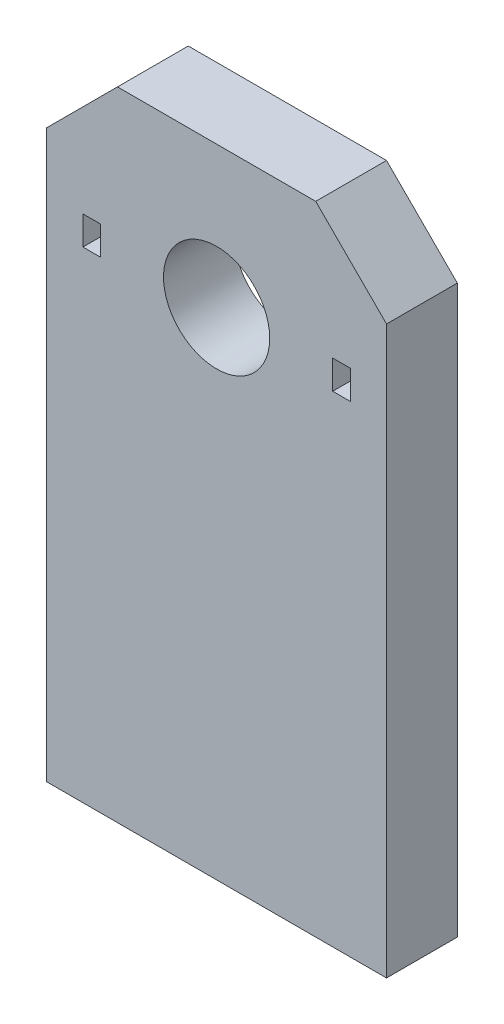
ISO-10303-21;
HEADER;
FILE_DESCRIPTION(('STEP AP214'),'2;1');
FILE_NAME('part.step','',(''),(''),'','','');
FILE_SCHEMA(('AUTOMOTIVE_DESIGN { 1 0 10303 214 1 1 1 1 }'));
ENDSEC;
DATA;
#1=APPLICATION_CONTEXT('core data for automotive mechanical design processes');
#2=APPLICATION_PROTOCOL_DEFINITION('international standard','automotive_design',2000,#1);
#3=PRODUCT_CONTEXT('',#1,'mechanical');
#4=PRODUCT('Part','Part','',(#3));
#5=PRODUCT_RELATED_PRODUCT_CATEGORY('part','',(#4));
#6=PRODUCT_DEFINITION_FORMATION('','',#4);
#7=PRODUCT_DEFINITION_CONTEXT('part definition',#1,'design');
#8=PRODUCT_DEFINITION('design','',#6,#7);
#9=PRODUCT_DEFINITION_SHAPE('','',#8);
#10=(LENGTH_UNIT() NAMED_UNIT(*) SI_UNIT(.MILLI.,.METRE.));
#11=(NAMED_UNIT(*) PLANE_ANGLE_UNIT() SI_UNIT($,.RADIAN.));
#12=(NAMED_UNIT(*) SI_UNIT($,.STERADIAN.) SOLID_ANGLE_UNIT());
#13=UNCERTAINTY_MEASURE_WITH_UNIT(LENGTH_MEASURE(1.E-05),#10,'distance_accuracy_value','');
#14=(GEOMETRIC_REPRESENTATION_CONTEXT(3) GLOBAL_UNCERTAINTY_ASSIGNED_CONTEXT((#13)) GLOBAL_UNIT_ASSIGNED_CONTEXT((#10,
#11,#12)) REPRESENTATION_CONTEXT('',''));
#15=CARTESIAN_POINT('',(0.,0.,0.));
#16=DIRECTION('',(0.,0.,1.));
#17=DIRECTION('',(1.,0.,0.));
#18=AXIS2_PLACEMENT_3D('',#15,#16,#17);
#19=CARTESIAN_POINT('',(0.,0.,6.35));
#20=DIRECTION('',(0.,0.,-1.));
#21=DIRECTION('',(-1.,0.,0.));
#22=AXIS2_PLACEMENT_3D('',#19,#20,#21);
#23=PLANE('',#22);
#24=DIRECTION('',(0.,1.,0.));
#25=VECTOR('',#24,1.);
#26=CARTESIAN_POINT('',(-10.414,45.73905,6.35));
#27=LINE('',#26,#25);
#28=CARTESIAN_POINT('',(-10.414,43.16095,6.35));
#29=VERTEX_POINT('',#28);
#30=CARTESIAN_POINT('',(-10.414,45.73905,6.35));
#31=VERTEX_POINT('',#30);
#32=EDGE_CURVE('E179',#29,#31,#27,.T.);
#33=ORIENTED_EDGE('',*,*,#32,.F.);
#34=DIRECTION('',(1.,0.,0.));
#35=VECTOR('',#34,1.);
#36=CARTESIAN_POINT('',(-11.9888,43.16095,6.35));
#37=LINE('',#36,#35);
#38=CARTESIAN_POINT('',(-11.9888,43.16095,6.35));
#39=VERTEX_POINT('',#38);
#40=EDGE_CURVE('E187',#39,#29,#37,.T.);
#41=ORIENTED_EDGE('',*,*,#40,.F.);
#42=DIRECTION('',(0.,-1.,0.));
#43=VECTOR('',#42,1.);
#44=CARTESIAN_POINT('',(-11.9888,45.73905,6.35));
#45=LINE('',#44,#43);
#46=CARTESIAN_POINT('',(-11.9888,45.73905,6.35));
#47=VERTEX_POINT('',#46);
#48=EDGE_CURVE('E184',#47,#39,#45,.T.);
#49=ORIENTED_EDGE('',*,*,#48,.F.);
#50=DIRECTION('',(-1.,0.,0.));
#51=VECTOR('',#50,1.);
#52=CARTESIAN_POINT('',(-11.9888,45.73905,6.35));
#53=LINE('',#52,#51);
#54=EDGE_CURVE('E181',#31,#47,#53,.T.);
#55=ORIENTED_EDGE('',*,*,#54,.F.);
#56=EDGE_LOOP('',(#33,#41,#49,#55));
#57=FACE_BOUND('',#56,.T.);
#58=DIRECTION('',(0.,1.,0.));
#59=VECTOR('',#58,1.);
#60=CARTESIAN_POINT('',(15.24,57.15,6.35));
#61=LINE('',#60,#59);
#62=CARTESIAN_POINT('',(15.24,0.,6.35));
#63=VERTEX_POINT('',#62);
#64=CARTESIAN_POINT('',(15.24,50.8,6.35));
#65=VERTEX_POINT('',#64);
#66=EDGE_CURVE('E223',#63,#65,#61,.T.);
#67=ORIENTED_EDGE('',*,*,#66,.T.);
#68=DIRECTION('',(0.707106781186546,-0.707106781186549,0.));
#69=VECTOR('',#68,1.);
#70=CARTESIAN_POINT('',(8.89000000000001,57.15,6.35));
#71=LINE('',#70,#69);
#72=CARTESIAN_POINT('',(8.89,57.15,6.35));
#73=VERTEX_POINT('',#72);
#74=EDGE_CURVE('E41',#65,#73,#71,.F.);
#75=ORIENTED_EDGE('',*,*,#74,.T.);
#76=DIRECTION('',(-1.,0.,0.));
#77=VECTOR('',#76,1.);
#78=CARTESIAN_POINT('',(-15.24,57.15,6.35));
#79=LINE('',#78,#77);
#80=CARTESIAN_POINT('',(-8.88999999999996,57.15,6.35));
#81=VERTEX_POINT('',#80);
#82=EDGE_CURVE('E216',#73,#81,#79,.T.);
#83=ORIENTED_EDGE('',*,*,#82,.T.);
#84=DIRECTION('',(0.707106781186548,0.707106781186547,0.));
#85=VECTOR('',#84,1.);
#86=CARTESIAN_POINT('',(-15.24,50.8,6.35));
#87=LINE('',#86,#85);
#88=CARTESIAN_POINT('',(-15.24,50.8,6.35));
#89=VERTEX_POINT('',#88);
#90=EDGE_CURVE('E48',#81,#89,#87,.F.);
#91=ORIENTED_EDGE('',*,*,#90,.T.);
#92=DIRECTION('',(0.,-1.,0.));
#93=VECTOR('',#92,1.);
#94=CARTESIAN_POINT('',(-15.24,57.15,6.35));
#95=LINE('',#94,#93);
#96=CARTESIAN_POINT('',(-15.24,0.,6.35));
#97=VERTEX_POINT('',#96);
#98=EDGE_CURVE('E218',#89,#97,#95,.T.);
#99=ORIENTED_EDGE('',*,*,#98,.T.);
#100=DIRECTION('',(1.,0.,0.));
#101=VECTOR('',#100,1.);
#102=CARTESIAN_POINT('',(-15.24,0.,6.35));
#103=LINE('',#102,#101);
#104=EDGE_CURVE('E221',#97,#63,#103,.T.);
#105=ORIENTED_EDGE('',*,*,#104,.T.);
#106=EDGE_LOOP('',(#67,#75,#83,#91,#99,#105));
#107=FACE_BOUND('',#106,.T.);
#108=CARTESIAN_POINT('',(0.,44.45,6.35));
#109=DIRECTION('',(0.,0.,1.));
#110=DIRECTION('',(1.,0.,0.));
#111=AXIS2_PLACEMENT_3D('',#108,#109,#110);
#112=CIRCLE('',#111,4.7625);
#113=CARTESIAN_POINT('',(4.7625,44.45,6.35));
#114=VERTEX_POINT('',#113);
#115=EDGE_CURVE('E210',#114,#114,#112,.T.);
#116=ORIENTED_EDGE('',*,*,#115,.F.);
#117=EDGE_LOOP('',(#116));
#118=FACE_BOUND('',#117,.T.);
#119=DIRECTION('',(0.,1.,0.));
#120=VECTOR('',#119,1.);
#121=CARTESIAN_POINT('',(11.9888,45.73905,6.35));
#122=LINE('',#121,#120);
#123=CARTESIAN_POINT('',(11.9888,43.16095,6.35));
#124=VERTEX_POINT('',#123);
#125=CARTESIAN_POINT('',(11.9888,45.73905,6.35));
#126=VERTEX_POINT('',#125);
#127=EDGE_CURVE('E138',#124,#126,#122,.T.);
#128=ORIENTED_EDGE('',*,*,#127,.F.);
#129=DIRECTION('',(1.,0.,0.));
#130=VECTOR('',#129,1.);
#131=CARTESIAN_POINT('',(10.414,43.16095,6.35));
#132=LINE('',#131,#130);
#133=CARTESIAN_POINT('',(10.414,43.16095,6.35));
#134=VERTEX_POINT('',#133);
#135=EDGE_CURVE('E163',#134,#124,#132,.T.);
#136=ORIENTED_EDGE('',*,*,#135,.F.);
#137=DIRECTION('',(0.,-1.,0.));
#138=VECTOR('',#137,1.);
#139=CARTESIAN_POINT('',(10.414,45.73905,6.35));
#140=LINE('',#139,#138);
#141=CARTESIAN_POINT('',(10.414,45.73905,6.35));
#142=VERTEX_POINT('',#141);
#143=EDGE_CURVE('E161',#142,#134,#140,.T.);
#144=ORIENTED_EDGE('',*,*,#143,.F.);
#145=DIRECTION('',(-1.,0.,0.));
#146=VECTOR('',#145,1.);
#147=CARTESIAN_POINT('',(10.414,45.73905,6.35));
#148=LINE('',#147,#146);
#149=EDGE_CURVE('E148',#126,#142,#148,.T.);
#150=ORIENTED_EDGE('',*,*,#149,.F.);
#151=EDGE_LOOP('',(#128,#136,#144,#150));
#152=FACE_BOUND('',#151,.T.);
#153=ADVANCED_FACE('F33',(#57,#107,#118,#152),#23,.F.);
#154=CARTESIAN_POINT('',(0.,0.,0.));
#155=DIRECTION('',(0.,0.,-1.));
#156=DIRECTION('',(-1.,0.,0.));
#157=AXIS2_PLACEMENT_3D('',#154,#155,#156);
#158=PLANE('',#157);
#159=DIRECTION('',(-1.,0.,0.));
#160=VECTOR('',#159,1.);
#161=CARTESIAN_POINT('',(-15.24,57.15,0.));
#162=LINE('',#161,#160);
#163=CARTESIAN_POINT('',(8.89,57.15,0.));
#164=VERTEX_POINT('',#163);
#165=CARTESIAN_POINT('',(-8.88999999999996,57.15,0.));
#166=VERTEX_POINT('',#165);
#167=EDGE_CURVE('E213',#164,#166,#162,.T.);
#168=ORIENTED_EDGE('',*,*,#167,.F.);
#169=DIRECTION('',(-0.707106781186546,0.707106781186549,0.));
#170=VECTOR('',#169,1.);
#171=CARTESIAN_POINT('',(33.02,33.0199999999999,0.));
#172=LINE('',#171,#170);
#173=CARTESIAN_POINT('',(15.24,50.8,0.));
#174=VERTEX_POINT('',#173);
#175=EDGE_CURVE('E245',#164,#174,#172,.F.);
#176=ORIENTED_EDGE('',*,*,#175,.T.);
#177=DIRECTION('',(0.,1.,0.));
#178=VECTOR('',#177,1.);
#179=CARTESIAN_POINT('',(15.24,57.15,0.));
#180=LINE('',#179,#178);
#181=CARTESIAN_POINT('',(15.24,0.,0.));
#182=VERTEX_POINT('',#181);
#183=EDGE_CURVE('E219',#182,#174,#180,.T.);
#184=ORIENTED_EDGE('',*,*,#183,.F.);
#185=DIRECTION('',(1.,0.,0.));
#186=VECTOR('',#185,1.);
#187=CARTESIAN_POINT('',(-15.24,0.,0.));
#188=LINE('',#187,#186);
#189=CARTESIAN_POINT('',(-15.24,0.,0.));
#190=VERTEX_POINT('',#189);
#191=EDGE_CURVE('E230',#190,#182,#188,.T.);
#192=ORIENTED_EDGE('',*,*,#191,.F.);
#193=DIRECTION('',(0.,-1.,0.));
#194=VECTOR('',#193,1.);
#195=CARTESIAN_POINT('',(-15.24,57.15,0.));
#196=LINE('',#195,#194);
#197=CARTESIAN_POINT('',(-15.24,50.8,0.));
#198=VERTEX_POINT('',#197);
#199=EDGE_CURVE('E228',#198,#190,#196,.T.);
#200=ORIENTED_EDGE('',*,*,#199,.F.);
#201=DIRECTION('',(-0.707106781186548,-0.707106781186547,0.));
#202=VECTOR('',#201,1.);
#203=CARTESIAN_POINT('',(-33.02,33.02,0.));
#204=LINE('',#203,#202);
#205=EDGE_CURVE('E243',#198,#166,#204,.F.);
#206=ORIENTED_EDGE('',*,*,#205,.T.);
#207=EDGE_LOOP('',(#168,#176,#184,#192,#200,#206));
#208=FACE_BOUND('',#207,.T.);
#209=CARTESIAN_POINT('',(0.,44.45,0.));
#210=DIRECTION('',(0.,0.,1.));
#211=DIRECTION('',(1.,0.,0.));
#212=AXIS2_PLACEMENT_3D('',#209,#210,#211);
#213=CIRCLE('',#212,4.7625);
#214=CARTESIAN_POINT('',(4.7625,44.45,0.));
#215=VERTEX_POINT('',#214);
#216=EDGE_CURVE('E209',#215,#215,#213,.T.);
#217=ORIENTED_EDGE('',*,*,#216,.T.);
#218=EDGE_LOOP('',(#217));
#219=FACE_BOUND('',#218,.T.);
#220=DIRECTION('',(1.,0.,0.));
#221=VECTOR('',#220,1.);
#222=CARTESIAN_POINT('',(-11.9888,43.16095,0.));
#223=LINE('',#222,#221);
#224=CARTESIAN_POINT('',(-11.9888,43.16095,0.));
#225=VERTEX_POINT('',#224);
#226=CARTESIAN_POINT('',(-10.414,43.16095,0.));
#227=VERTEX_POINT('',#226);
#228=EDGE_CURVE('E182',#225,#227,#223,.T.);
#229=ORIENTED_EDGE('',*,*,#228,.T.);
#230=DIRECTION('',(0.,1.,0.));
#231=VECTOR('',#230,1.);
#232=CARTESIAN_POINT('',(-10.414,45.73905,0.));
#233=LINE('',#232,#231);
#234=CARTESIAN_POINT('',(-10.414,45.73905,0.));
#235=VERTEX_POINT('',#234);
#236=EDGE_CURVE('E156',#227,#235,#233,.T.);
#237=ORIENTED_EDGE('',*,*,#236,.T.);
#238=DIRECTION('',(-1.,0.,0.));
#239=VECTOR('',#238,1.);
#240=CARTESIAN_POINT('',(-11.9888,45.73905,0.));
#241=LINE('',#240,#239);
#242=CARTESIAN_POINT('',(-11.9888,45.73905,0.));
#243=VERTEX_POINT('',#242);
#244=EDGE_CURVE('E192',#235,#243,#241,.T.);
#245=ORIENTED_EDGE('',*,*,#244,.T.);
#246=DIRECTION('',(0.,-1.,0.));
#247=VECTOR('',#246,1.);
#248=CARTESIAN_POINT('',(-11.9888,45.73905,0.));
#249=LINE('',#248,#247);
#250=EDGE_CURVE('E195',#243,#225,#249,.T.);
#251=ORIENTED_EDGE('',*,*,#250,.T.);
#252=EDGE_LOOP('',(#229,#237,#245,#251));
#253=FACE_BOUND('',#252,.T.);
#254=DIRECTION('',(1.,0.,0.));
#255=VECTOR('',#254,1.);
#256=CARTESIAN_POINT('',(10.414,43.16095,0.));
#257=LINE('',#256,#255);
#258=CARTESIAN_POINT('',(10.414,43.16095,0.));
#259=VERTEX_POINT('',#258);
#260=CARTESIAN_POINT('',(11.9888,43.16095,0.));
#261=VERTEX_POINT('',#260);
#262=EDGE_CURVE('E149',#259,#261,#257,.T.);
#263=ORIENTED_EDGE('',*,*,#262,.T.);
#264=DIRECTION('',(0.,1.,0.));
#265=VECTOR('',#264,1.);
#266=CARTESIAN_POINT('',(11.9888,45.73905,0.));
#267=LINE('',#266,#265);
#268=CARTESIAN_POINT('',(11.9888,45.73905,0.));
#269=VERTEX_POINT('',#268);
#270=EDGE_CURVE('E167',#261,#269,#267,.T.);
#271=ORIENTED_EDGE('',*,*,#270,.T.);
#272=DIRECTION('',(-1.,0.,0.));
#273=VECTOR('',#272,1.);
#274=CARTESIAN_POINT('',(10.414,45.73905,0.));
#275=LINE('',#274,#273);
#276=CARTESIAN_POINT('',(10.414,45.73905,0.));
#277=VERTEX_POINT('',#276);
#278=EDGE_CURVE('E155',#269,#277,#275,.T.);
#279=ORIENTED_EDGE('',*,*,#278,.T.);
#280=DIRECTION('',(0.,-1.,0.));
#281=VECTOR('',#280,1.);
#282=CARTESIAN_POINT('',(10.414,45.73905,0.));
#283=LINE('',#282,#281);
#284=EDGE_CURVE('E170',#277,#259,#283,.T.);
#285=ORIENTED_EDGE('',*,*,#284,.T.);
#286=EDGE_LOOP('',(#263,#271,#279,#285));
#287=FACE_BOUND('',#286,.T.);
#288=ADVANCED_FACE('F260',(#208,#219,#253,#287),#158,.T.);
#289=CARTESIAN_POINT('',(-15.24,57.15,6.35));
#290=DIRECTION('',(0.,-1.,0.));
#291=DIRECTION('',(1.,0.,0.));
#292=AXIS2_PLACEMENT_3D('',#289,#290,#291);
#293=PLANE('',#292);
#294=ORIENTED_EDGE('',*,*,#82,.F.);
#295=DIRECTION('',(0.,0.,-1.));
#296=VECTOR('',#295,1.);
#297=CARTESIAN_POINT('',(8.89000000000001,57.15,6.35));
#298=LINE('',#297,#296);
#299=EDGE_CURVE('E240',#73,#164,#298,.T.);
#300=ORIENTED_EDGE('',*,*,#299,.T.);
#301=ORIENTED_EDGE('',*,*,#167,.T.);
#302=DIRECTION('',(0.,0.,1.));
#303=VECTOR('',#302,1.);
#304=CARTESIAN_POINT('',(-8.88999999999996,57.15,6.35));
#305=LINE('',#304,#303);
#306=EDGE_CURVE('E238',#166,#81,#305,.T.);
#307=ORIENTED_EDGE('',*,*,#306,.T.);
#308=EDGE_LOOP('',(#294,#300,#301,#307));
#309=FACE_BOUND('',#308,.T.);
#310=ADVANCED_FACE('F254',(#309),#293,.F.);
#311=CARTESIAN_POINT('',(-15.24,57.15,6.35));
#312=DIRECTION('',(1.,0.,0.));
#313=DIRECTION('',(0.,1.,0.));
#314=AXIS2_PLACEMENT_3D('',#311,#312,#313);
#315=PLANE('',#314);
#316=ORIENTED_EDGE('',*,*,#98,.F.);
#317=DIRECTION('',(0.,0.,-1.));
#318=VECTOR('',#317,1.);
#319=CARTESIAN_POINT('',(-15.24,50.8,6.35));
#320=LINE('',#319,#318);
#321=EDGE_CURVE('E11',#89,#198,#320,.T.);
#322=ORIENTED_EDGE('',*,*,#321,.T.);
#323=ORIENTED_EDGE('',*,*,#199,.T.);
#324=DIRECTION('',(0.,0.,-1.));
#325=VECTOR('',#324,1.);
#326=CARTESIAN_POINT('',(-15.24,0.,6.35));
#327=LINE('',#326,#325);
#328=EDGE_CURVE('E235',#97,#190,#327,.T.);
#329=ORIENTED_EDGE('',*,*,#328,.F.);
#330=EDGE_LOOP('',(#316,#322,#323,#329));
#331=FACE_BOUND('',#330,.T.);
#332=ADVANCED_FACE('F271',(#331),#315,.F.);
#333=CARTESIAN_POINT('',(-15.24,0.,6.35));
#334=DIRECTION('',(0.,1.,0.));
#335=DIRECTION('',(-1.,0.,0.));
#336=AXIS2_PLACEMENT_3D('',#333,#334,#335);
#337=PLANE('',#336);
#338=ORIENTED_EDGE('',*,*,#191,.T.);
#339=DIRECTION('',(0.,0.,-1.));
#340=VECTOR('',#339,1.);
#341=CARTESIAN_POINT('',(15.24,0.,6.35));
#342=LINE('',#341,#340);
#343=EDGE_CURVE('E225',#63,#182,#342,.T.);
#344=ORIENTED_EDGE('',*,*,#343,.F.);
#345=ORIENTED_EDGE('',*,*,#104,.F.);
#346=ORIENTED_EDGE('',*,*,#328,.T.);
#347=EDGE_LOOP('',(#338,#344,#345,#346));
#348=FACE_BOUND('',#347,.T.);
#349=ADVANCED_FACE('F267',(#348),#337,.F.);
#350=CARTESIAN_POINT('',(15.24,57.15,6.35));
#351=DIRECTION('',(-1.,0.,0.));
#352=DIRECTION('',(0.,-1.,0.));
#353=AXIS2_PLACEMENT_3D('',#350,#351,#352);
#354=PLANE('',#353);
#355=ORIENTED_EDGE('',*,*,#183,.T.);
#356=DIRECTION('',(0.,0.,1.));
#357=VECTOR('',#356,1.);
#358=CARTESIAN_POINT('',(15.24,50.8,6.35));
#359=LINE('',#358,#357);
#360=EDGE_CURVE('E56',#174,#65,#359,.T.);
#361=ORIENTED_EDGE('',*,*,#360,.T.);
#362=ORIENTED_EDGE('',*,*,#66,.F.);
#363=ORIENTED_EDGE('',*,*,#343,.T.);
#364=EDGE_LOOP('',(#355,#361,#362,#363));
#365=FACE_BOUND('',#364,.T.);
#366=ADVANCED_FACE('F263',(#365),#354,.F.);
#367=CARTESIAN_POINT('',(0.,44.45,6.35));
#368=DIRECTION('',(0.,0.,-1.));
#369=DIRECTION('',(-1.,0.,0.));
#370=AXIS2_PLACEMENT_3D('',#367,#368,#369);
#371=CYLINDRICAL_SURFACE('',#370,4.7625);
#372=ORIENTED_EDGE('',*,*,#115,.T.);
#373=EDGE_LOOP('',(#372));
#374=FACE_BOUND('',#373,.T.);
#375=ORIENTED_EDGE('',*,*,#216,.F.);
#376=EDGE_LOOP('',(#375));
#377=FACE_BOUND('',#376,.T.);
#378=ADVANCED_FACE('F288',(#374,#377),#371,.F.);
#379=CARTESIAN_POINT('',(-10.414,45.73905,6.35));
#380=DIRECTION('',(-1.,0.,0.));
#381=DIRECTION('',(0.,0.,1.));
#382=AXIS2_PLACEMENT_3D('',#379,#380,#381);
#383=PLANE('',#382);
#384=ORIENTED_EDGE('',*,*,#236,.F.);
#385=DIRECTION('',(0.,0.,-1.));
#386=VECTOR('',#385,1.);
#387=CARTESIAN_POINT('',(-10.414,43.16095,6.35));
#388=LINE('',#387,#386);
#389=EDGE_CURVE('E189',#29,#227,#388,.T.);
#390=ORIENTED_EDGE('',*,*,#389,.F.);
#391=ORIENTED_EDGE('',*,*,#32,.T.);
#392=DIRECTION('',(0.,0.,-1.));
#393=VECTOR('',#392,1.);
#394=CARTESIAN_POINT('',(-10.414,45.73905,6.35));
#395=LINE('',#394,#393);
#396=EDGE_CURVE('E206',#31,#235,#395,.T.);
#397=ORIENTED_EDGE('',*,*,#396,.T.);
#398=EDGE_LOOP('',(#384,#390,#391,#397));
#399=FACE_BOUND('',#398,.T.);
#400=ADVANCED_FACE('F321',(#399),#383,.T.);
#401=CARTESIAN_POINT('',(-11.9888,45.73905,6.35));
#402=DIRECTION('',(0.,-1.,0.));
#403=DIRECTION('',(0.,0.,-1.));
#404=AXIS2_PLACEMENT_3D('',#401,#402,#403);
#405=PLANE('',#404);
#406=ORIENTED_EDGE('',*,*,#244,.F.);
#407=ORIENTED_EDGE('',*,*,#396,.F.);
#408=ORIENTED_EDGE('',*,*,#54,.T.);
#409=DIRECTION('',(0.,0.,-1.));
#410=VECTOR('',#409,1.);
#411=CARTESIAN_POINT('',(-11.9888,45.73905,6.35));
#412=LINE('',#411,#410);
#413=EDGE_CURVE('E204',#47,#243,#412,.T.);
#414=ORIENTED_EDGE('',*,*,#413,.T.);
#415=EDGE_LOOP('',(#406,#407,#408,#414));
#416=FACE_BOUND('',#415,.T.);
#417=ADVANCED_FACE('F328',(#416),#405,.T.);
#418=CARTESIAN_POINT('',(-11.9888,45.73905,6.35));
#419=DIRECTION('',(1.,0.,0.));
#420=DIRECTION('',(0.,0.,-1.));
#421=AXIS2_PLACEMENT_3D('',#418,#419,#420);
#422=PLANE('',#421);
#423=ORIENTED_EDGE('',*,*,#250,.F.);
#424=ORIENTED_EDGE('',*,*,#413,.F.);
#425=ORIENTED_EDGE('',*,*,#48,.T.);
#426=DIRECTION('',(0.,0.,-1.));
#427=VECTOR('',#426,1.);
#428=CARTESIAN_POINT('',(-11.9888,43.16095,6.35));
#429=LINE('',#428,#427);
#430=EDGE_CURVE('E202',#39,#225,#429,.T.);
#431=ORIENTED_EDGE('',*,*,#430,.T.);
#432=EDGE_LOOP('',(#423,#424,#425,#431));
#433=FACE_BOUND('',#432,.T.);
#434=ADVANCED_FACE('F335',(#433),#422,.T.);
#435=CARTESIAN_POINT('',(-11.9888,43.16095,6.35));
#436=DIRECTION('',(0.,1.,0.));
#437=DIRECTION('',(0.,0.,1.));
#438=AXIS2_PLACEMENT_3D('',#435,#436,#437);
#439=PLANE('',#438);
#440=ORIENTED_EDGE('',*,*,#228,.F.);
#441=ORIENTED_EDGE('',*,*,#430,.F.);
#442=ORIENTED_EDGE('',*,*,#40,.T.);
#443=ORIENTED_EDGE('',*,*,#389,.T.);
#444=EDGE_LOOP('',(#440,#441,#442,#443));
#445=FACE_BOUND('',#444,.T.);
#446=ADVANCED_FACE('F343',(#445),#439,.T.);
#447=CARTESIAN_POINT('',(11.9888,45.73905,6.35));
#448=DIRECTION('',(-1.,0.,0.));
#449=DIRECTION('',(0.,0.,1.));
#450=AXIS2_PLACEMENT_3D('',#447,#448,#449);
#451=PLANE('',#450);
#452=ORIENTED_EDGE('',*,*,#270,.F.);
#453=DIRECTION('',(0.,0.,-1.));
#454=VECTOR('',#453,1.);
#455=CARTESIAN_POINT('',(11.9888,43.16095,6.35));
#456=LINE('',#455,#454);
#457=EDGE_CURVE('E144',#124,#261,#456,.T.);
#458=ORIENTED_EDGE('',*,*,#457,.F.);
#459=ORIENTED_EDGE('',*,*,#127,.T.);
#460=DIRECTION('',(0.,0.,-1.));
#461=VECTOR('',#460,1.);
#462=CARTESIAN_POINT('',(11.9888,45.73905,6.35));
#463=LINE('',#462,#461);
#464=EDGE_CURVE('E141',#126,#269,#463,.T.);
#465=ORIENTED_EDGE('',*,*,#464,.T.);
#466=EDGE_LOOP('',(#452,#458,#459,#465));
#467=FACE_BOUND('',#466,.T.);
#468=ADVANCED_FACE('F140',(#467),#451,.T.);
#469=CARTESIAN_POINT('',(10.414,45.73905,6.35));
#470=DIRECTION('',(0.,-1.,0.));
#471=DIRECTION('',(0.,0.,-1.));
#472=AXIS2_PLACEMENT_3D('',#469,#470,#471);
#473=PLANE('',#472);
#474=ORIENTED_EDGE('',*,*,#278,.F.);
#475=ORIENTED_EDGE('',*,*,#464,.F.);
#476=ORIENTED_EDGE('',*,*,#149,.T.);
#477=DIRECTION('',(0.,0.,-1.));
#478=VECTOR('',#477,1.);
#479=CARTESIAN_POINT('',(10.414,45.73905,6.35));
#480=LINE('',#479,#478);
#481=EDGE_CURVE('E157',#142,#277,#480,.T.);
#482=ORIENTED_EDGE('',*,*,#481,.T.);
#483=EDGE_LOOP('',(#474,#475,#476,#482));
#484=FACE_BOUND('',#483,.T.);
#485=ADVANCED_FACE('F152',(#484),#473,.T.);
#486=CARTESIAN_POINT('',(10.414,45.73905,6.35));
#487=DIRECTION('',(1.,0.,0.));
#488=DIRECTION('',(0.,0.,-1.));
#489=AXIS2_PLACEMENT_3D('',#486,#487,#488);
#490=PLANE('',#489);
#491=ORIENTED_EDGE('',*,*,#284,.F.);
#492=ORIENTED_EDGE('',*,*,#481,.F.);
#493=ORIENTED_EDGE('',*,*,#143,.T.);
#494=DIRECTION('',(0.,0.,-1.));
#495=VECTOR('',#494,1.);
#496=CARTESIAN_POINT('',(10.414,43.16095,6.35));
#497=LINE('',#496,#495);
#498=EDGE_CURVE('E176',#134,#259,#497,.T.);
#499=ORIENTED_EDGE('',*,*,#498,.T.);
#500=EDGE_LOOP('',(#491,#492,#493,#499));
#501=FACE_BOUND('',#500,.T.);
#502=ADVANCED_FACE('F364',(#501),#490,.T.);
#503=CARTESIAN_POINT('',(10.414,43.16095,6.35));
#504=DIRECTION('',(0.,1.,0.));
#505=DIRECTION('',(0.,0.,1.));
#506=AXIS2_PLACEMENT_3D('',#503,#504,#505);
#507=PLANE('',#506);
#508=ORIENTED_EDGE('',*,*,#262,.F.);
#509=ORIENTED_EDGE('',*,*,#498,.F.);
#510=ORIENTED_EDGE('',*,*,#135,.T.);
#511=ORIENTED_EDGE('',*,*,#457,.T.);
#512=EDGE_LOOP('',(#508,#509,#510,#511));
#513=FACE_BOUND('',#512,.T.);
#514=ADVANCED_FACE('F278',(#513),#507,.T.);
#515=CARTESIAN_POINT('',(8.89000000000001,57.15,6.35));
#516=DIRECTION('',(-0.707106781186549,-0.707106781186546,0.));
#517=DIRECTION('',(0.,0.,-1.));
#518=AXIS2_PLACEMENT_3D('',#515,#516,#517);
#519=PLANE('',#518);
#520=ORIENTED_EDGE('',*,*,#74,.F.);
#521=ORIENTED_EDGE('',*,*,#360,.F.);
#522=ORIENTED_EDGE('',*,*,#175,.F.);
#523=ORIENTED_EDGE('',*,*,#299,.F.);
#524=EDGE_LOOP('',(#520,#521,#522,#523));
#525=FACE_BOUND('',#524,.T.);
#526=ADVANCED_FACE('F257',(#525),#519,.F.);
#527=CARTESIAN_POINT('',(-15.24,50.8,6.35));
#528=DIRECTION('',(0.707106781186547,-0.707106781186548,0.));
#529=DIRECTION('',(0.,0.,-1.));
#530=AXIS2_PLACEMENT_3D('',#527,#528,#529);
#531=PLANE('',#530);
#532=ORIENTED_EDGE('',*,*,#90,.F.);
#533=ORIENTED_EDGE('',*,*,#306,.F.);
#534=ORIENTED_EDGE('',*,*,#205,.F.);
#535=ORIENTED_EDGE('',*,*,#321,.F.);
#536=EDGE_LOOP('',(#532,#533,#534,#535));
#537=FACE_BOUND('',#536,.T.);
#538=ADVANCED_FACE('F35',(#537),#531,.F.);
#539=CLOSED_SHELL('',(#153,#288,#310,#332,#349,#366,#378,#400,#417,#434,#446,#468,#485,#502,
#514,#526,#538));
#540=MANIFOLD_SOLID_BREP('B2',#539);
#541=ADVANCED_BREP_SHAPE_REPRESENTATION('',(#18,#540),#14);
#542=SHAPE_DEFINITION_REPRESENTATION(#9,#541);
ENDSEC;
END-ISO-10303-21;
